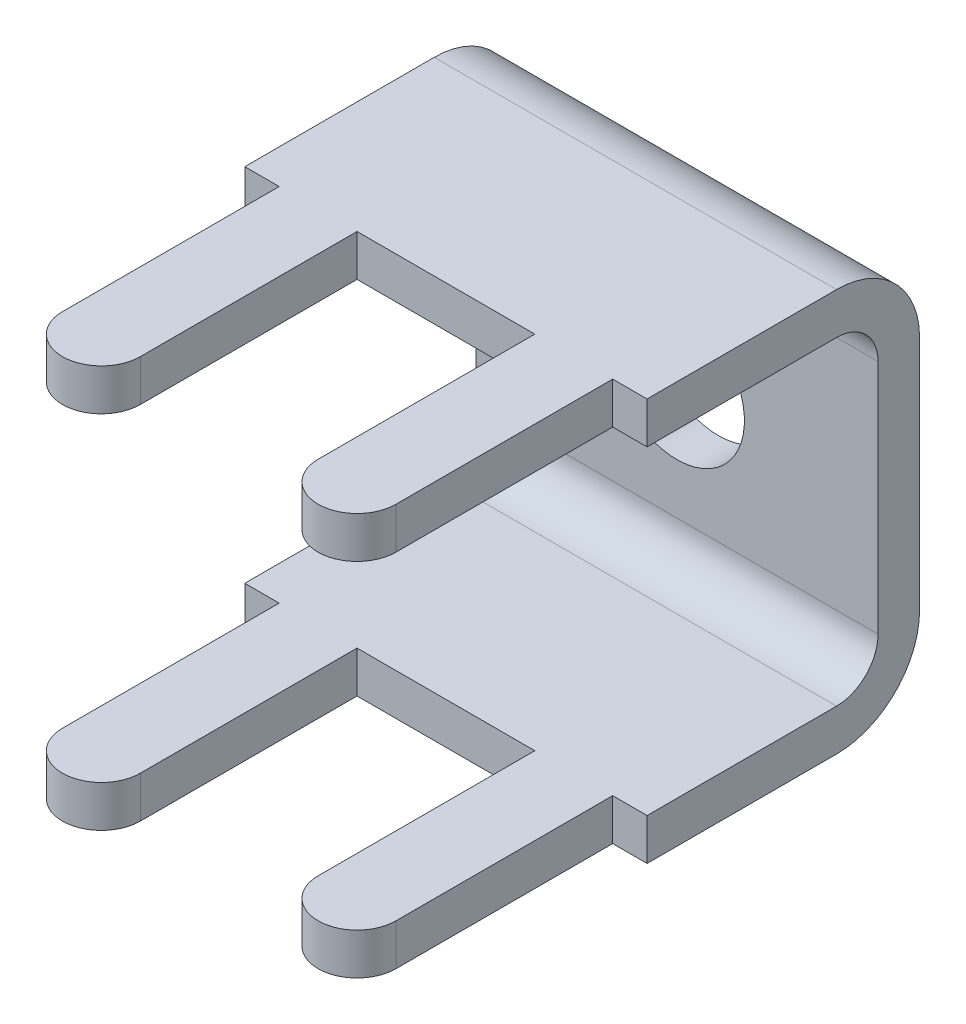
ISO-10303-21;
HEADER;
FILE_DESCRIPTION(('STEP AP214'),'2;1');
FILE_NAME('part.step','',(''),(''),'','','');
FILE_SCHEMA(('AUTOMOTIVE_DESIGN { 1 0 10303 214 1 1 1 1 }'));
ENDSEC;
DATA;
#1=APPLICATION_CONTEXT('core data for automotive mechanical design processes');
#2=APPLICATION_PROTOCOL_DEFINITION('international standard','automotive_design',2000,#1);
#3=PRODUCT_CONTEXT('',#1,'mechanical');
#4=PRODUCT('Part','Part','',(#3));
#5=PRODUCT_RELATED_PRODUCT_CATEGORY('part','',(#4));
#6=PRODUCT_DEFINITION_FORMATION('','',#4);
#7=PRODUCT_DEFINITION_CONTEXT('part definition',#1,'design');
#8=PRODUCT_DEFINITION('design','',#6,#7);
#9=PRODUCT_DEFINITION_SHAPE('','',#8);
#10=(LENGTH_UNIT() NAMED_UNIT(*) SI_UNIT(.MILLI.,.METRE.));
#11=(NAMED_UNIT(*) PLANE_ANGLE_UNIT() SI_UNIT($,.RADIAN.));
#12=(NAMED_UNIT(*) SI_UNIT($,.STERADIAN.) SOLID_ANGLE_UNIT());
#13=UNCERTAINTY_MEASURE_WITH_UNIT(LENGTH_MEASURE(1.E-05),#10,'distance_accuracy_value','');
#14=(GEOMETRIC_REPRESENTATION_CONTEXT(3) GLOBAL_UNCERTAINTY_ASSIGNED_CONTEXT((#13)) GLOBAL_UNIT_ASSIGNED_CONTEXT((#10,
#11,#12)) REPRESENTATION_CONTEXT('',''));
#15=CARTESIAN_POINT('',(0.,0.,0.));
#16=DIRECTION('',(0.,0.,1.));
#17=DIRECTION('',(1.,0.,0.));
#18=AXIS2_PLACEMENT_3D('',#15,#16,#17);
#19=CARTESIAN_POINT('',(3.937,3.937,0.812800000000003));
#20=DIRECTION('',(0.,0.,-1.));
#21=DIRECTION('',(-1.,0.,0.));
#22=AXIS2_PLACEMENT_3D('',#19,#20,#21);
#23=CYLINDRICAL_SURFACE('',#22,1.3208);
#24=CARTESIAN_POINT('',(3.937,3.937,0.));
#25=DIRECTION('',(0.,0.,-1.));
#26=DIRECTION('',(-1.,0.,0.));
#27=AXIS2_PLACEMENT_3D('',#24,#25,#26);
#28=CIRCLE('',#27,1.3208);
#29=CARTESIAN_POINT('',(2.6162,3.937,0.));
#30=VERTEX_POINT('',#29);
#31=EDGE_CURVE('E387',#30,#30,#28,.F.);
#32=ORIENTED_EDGE('',*,*,#31,.F.);
#33=EDGE_LOOP('',(#32));
#34=FACE_BOUND('',#33,.T.);
#35=CARTESIAN_POINT('',(3.937,3.937,0.8128));
#36=DIRECTION('',(0.,0.,-1.));
#37=DIRECTION('',(-1.,0.,0.));
#38=AXIS2_PLACEMENT_3D('',#35,#36,#37);
#39=CIRCLE('',#38,1.3208);
#40=CARTESIAN_POINT('',(2.6162,3.937,0.8128));
#41=VERTEX_POINT('',#40);
#42=EDGE_CURVE('E218',#41,#41,#39,.T.);
#43=ORIENTED_EDGE('',*,*,#42,.F.);
#44=EDGE_LOOP('',(#43));
#45=FACE_BOUND('',#44,.T.);
#46=ADVANCED_FACE('F17',(#34,#45),#23,.F.);
#47=CARTESIAN_POINT('',(7.874,1.6256,1.6256));
#48=DIRECTION('',(-1.,0.,0.));
#49=DIRECTION('',(0.,0.,1.));
#50=AXIS2_PLACEMENT_3D('',#47,#48,#49);
#51=CYLINDRICAL_SURFACE('',#50,0.8128);
#52=DIRECTION('',(1.,0.,0.));
#53=VECTOR('',#52,1.);
#54=CARTESIAN_POINT('',(-0.3937,1.6256,0.8128));
#55=LINE('',#54,#53);
#56=CARTESIAN_POINT('',(0.,1.6256,0.8128));
#57=VERTEX_POINT('',#56);
#58=CARTESIAN_POINT('',(7.874,1.6256,0.8128));
#59=VERTEX_POINT('',#58);
#60=EDGE_CURVE('E205',#57,#59,#55,.T.);
#61=ORIENTED_EDGE('',*,*,#60,.F.);
#62=CARTESIAN_POINT('',(0.,1.6256,1.6256));
#63=DIRECTION('',(-1.,0.,0.));
#64=DIRECTION('',(0.,0.,1.));
#65=AXIS2_PLACEMENT_3D('',#62,#63,#64);
#66=CIRCLE('',#65,0.8128);
#67=CARTESIAN_POINT('',(0.,0.8128,1.6256));
#68=VERTEX_POINT('',#67);
#69=EDGE_CURVE('E210',#57,#68,#66,.T.);
#70=ORIENTED_EDGE('',*,*,#69,.T.);
#71=DIRECTION('',(1.,0.,0.));
#72=VECTOR('',#71,1.);
#73=CARTESIAN_POINT('',(-0.3937,0.8128,1.6256));
#74=LINE('',#73,#72);
#75=CARTESIAN_POINT('',(7.874,0.812800000000002,1.6256));
#76=VERTEX_POINT('',#75);
#77=EDGE_CURVE('E208',#76,#68,#74,.F.);
#78=ORIENTED_EDGE('',*,*,#77,.F.);
#79=CARTESIAN_POINT('',(7.874,1.6256,1.6256));
#80=DIRECTION('',(-1.,0.,0.));
#81=DIRECTION('',(0.,0.,1.));
#82=AXIS2_PLACEMENT_3D('',#79,#80,#81);
#83=CIRCLE('',#82,0.8128);
#84=EDGE_CURVE('E20',#76,#59,#83,.F.);
#85=ORIENTED_EDGE('',*,*,#84,.T.);
#86=EDGE_LOOP('',(#61,#70,#78,#85));
#87=FACE_BOUND('',#86,.T.);
#88=ADVANCED_FACE('F204',(#87),#51,.F.);
#89=CARTESIAN_POINT('',(6.4389,0.8128,9.5758));
#90=DIRECTION('',(0.,1.,0.));
#91=DIRECTION('',(0.,0.,1.));
#92=AXIS2_PLACEMENT_3D('',#89,#90,#91);
#93=CYLINDRICAL_SURFACE('',#92,0.761999999999983);
#94=CARTESIAN_POINT('',(6.4389,0.,9.5758));
#95=DIRECTION('',(0.,1.,0.));
#96=DIRECTION('',(0.,0.,1.));
#97=AXIS2_PLACEMENT_3D('',#94,#95,#96);
#98=CIRCLE('',#97,0.761999999999983);
#99=CARTESIAN_POINT('',(7.2009,0.,9.5758));
#100=VERTEX_POINT('',#99);
#101=CARTESIAN_POINT('',(5.6769,0.,9.5758));
#102=VERTEX_POINT('',#101);
#103=EDGE_CURVE('E376',#100,#102,#98,.F.);
#104=ORIENTED_EDGE('',*,*,#103,.F.);
#105=DIRECTION('',(0.,1.,0.));
#106=VECTOR('',#105,1.);
#107=CARTESIAN_POINT('',(7.2009,-0.0406399999999987,9.5758));
#108=LINE('',#107,#106);
#109=CARTESIAN_POINT('',(7.2009,0.8128,9.5758));
#110=VERTEX_POINT('',#109);
#111=EDGE_CURVE('E410',#110,#100,#108,.F.);
#112=ORIENTED_EDGE('',*,*,#111,.F.);
#113=CARTESIAN_POINT('',(6.4389,0.8128,9.5758));
#114=DIRECTION('',(0.,1.,0.));
#115=DIRECTION('',(0.,0.,1.));
#116=AXIS2_PLACEMENT_3D('',#113,#114,#115);
#117=CIRCLE('',#116,0.761999999999983);
#118=CARTESIAN_POINT('',(5.6769,0.8128,9.5758));
#119=VERTEX_POINT('',#118);
#120=EDGE_CURVE('E476',#119,#110,#117,.T.);
#121=ORIENTED_EDGE('',*,*,#120,.F.);
#122=DIRECTION('',(0.,1.,0.));
#123=VECTOR('',#122,1.);
#124=CARTESIAN_POINT('',(5.6769,-0.040639999999999,9.5758));
#125=LINE('',#124,#123);
#126=EDGE_CURVE('E438',#102,#119,#125,.T.);
#127=ORIENTED_EDGE('',*,*,#126,.F.);
#128=EDGE_LOOP('',(#104,#112,#121,#127));
#129=FACE_BOUND('',#128,.T.);
#130=ADVANCED_FACE('F757',(#129),#93,.T.);
#131=CARTESIAN_POINT('',(5.6769,-0.040639999999999,5.12191));
#132=DIRECTION('',(-1.,0.,0.));
#133=DIRECTION('',(0.,0.,1.));
#134=AXIS2_PLACEMENT_3D('',#131,#132,#133);
#135=PLANE('',#134);
#136=DIRECTION('',(0.,1.,0.));
#137=VECTOR('',#136,1.);
#138=CARTESIAN_POINT('',(5.6769,-0.0406399999999995,5.334));
#139=LINE('',#138,#137);
#140=CARTESIAN_POINT('',(5.6769,0.,5.334));
#141=VERTEX_POINT('',#140);
#142=CARTESIAN_POINT('',(5.6769,0.8128,5.334));
#143=VERTEX_POINT('',#142);
#144=EDGE_CURVE('E427',#141,#143,#139,.T.);
#145=ORIENTED_EDGE('',*,*,#144,.F.);
#146=DIRECTION('',(0.,0.,-1.));
#147=VECTOR('',#146,1.);
#148=CARTESIAN_POINT('',(5.6769,0.,10.77341));
#149=LINE('',#148,#147);
#150=EDGE_CURVE('E434',#102,#141,#149,.T.);
#151=ORIENTED_EDGE('',*,*,#150,.F.);
#152=ORIENTED_EDGE('',*,*,#126,.T.);
#153=DIRECTION('',(0.,0.,1.));
#154=VECTOR('',#153,1.);
#155=CARTESIAN_POINT('',(5.6769,0.8128,1.18999));
#156=LINE('',#155,#154);
#157=EDGE_CURVE('E416',#143,#119,#156,.T.);
#158=ORIENTED_EDGE('',*,*,#157,.F.);
#159=EDGE_LOOP('',(#145,#151,#152,#158));
#160=FACE_BOUND('',#159,.T.);
#161=ADVANCED_FACE('F749',(#160),#135,.T.);
#162=CARTESIAN_POINT('',(2.02311,-0.0406399999999995,5.334));
#163=DIRECTION('',(0.,0.,1.));
#164=DIRECTION('',(1.,0.,0.));
#165=AXIS2_PLACEMENT_3D('',#162,#163,#164);
#166=PLANE('',#165);
#167=ORIENTED_EDGE('',*,*,#144,.T.);
#168=DIRECTION('',(1.,0.,0.));
#169=VECTOR('',#168,1.);
#170=CARTESIAN_POINT('',(-0.3937,0.8128,5.334));
#171=LINE('',#170,#169);
#172=CARTESIAN_POINT('',(2.1971,0.8128,5.334));
#173=VERTEX_POINT('',#172);
#174=EDGE_CURVE('E443',#173,#143,#171,.T.);
#175=ORIENTED_EDGE('',*,*,#174,.F.);
#176=DIRECTION('',(0.,1.,0.));
#177=VECTOR('',#176,1.);
#178=CARTESIAN_POINT('',(2.1971,-0.0406399999999995,5.334));
#179=LINE('',#178,#177);
#180=CARTESIAN_POINT('',(2.1971,0.,5.334));
#181=VERTEX_POINT('',#180);
#182=EDGE_CURVE('E425',#181,#173,#179,.T.);
#183=ORIENTED_EDGE('',*,*,#182,.F.);
#184=DIRECTION('',(1.,0.,0.));
#185=VECTOR('',#184,1.);
#186=CARTESIAN_POINT('',(-0.3937,0.,5.334));
#187=LINE('',#186,#185);
#188=EDGE_CURVE('E430',#141,#181,#187,.F.);
#189=ORIENTED_EDGE('',*,*,#188,.F.);
#190=EDGE_LOOP('',(#167,#175,#183,#189));
#191=FACE_BOUND('',#190,.T.);
#192=ADVANCED_FACE('F741',(#191),#166,.T.);
#193=CARTESIAN_POINT('',(2.1971,-0.0406399999999995,9.78789));
#194=DIRECTION('',(1.,0.,0.));
#195=DIRECTION('',(0.,0.,-1.));
#196=AXIS2_PLACEMENT_3D('',#193,#194,#195);
#197=PLANE('',#196);
#198=ORIENTED_EDGE('',*,*,#182,.T.);
#199=DIRECTION('',(0.,0.,1.));
#200=VECTOR('',#199,1.);
#201=CARTESIAN_POINT('',(2.1971,0.8128,1.18999));
#202=LINE('',#201,#200);
#203=CARTESIAN_POINT('',(2.19710000000001,0.8128,9.5758));
#204=VERTEX_POINT('',#203);
#205=EDGE_CURVE('E446',#204,#173,#202,.F.);
#206=ORIENTED_EDGE('',*,*,#205,.F.);
#207=DIRECTION('',(0.,1.,0.));
#208=VECTOR('',#207,1.);
#209=CARTESIAN_POINT('',(2.19710000000001,0.4064,9.5758));
#210=LINE('',#209,#208);
#211=CARTESIAN_POINT('',(2.19710000000001,0.,9.5758));
#212=VERTEX_POINT('',#211);
#213=EDGE_CURVE('E423',#212,#204,#210,.T.);
#214=ORIENTED_EDGE('',*,*,#213,.F.);
#215=DIRECTION('',(0.,0.,-1.));
#216=VECTOR('',#215,1.);
#217=CARTESIAN_POINT('',(2.1971,0.,10.77341));
#218=LINE('',#217,#216);
#219=EDGE_CURVE('E433',#181,#212,#218,.F.);
#220=ORIENTED_EDGE('',*,*,#219,.F.);
#221=EDGE_LOOP('',(#198,#206,#214,#220));
#222=FACE_BOUND('',#221,.T.);
#223=ADVANCED_FACE('F733',(#222),#197,.T.);
#224=CARTESIAN_POINT('',(1.4351,0.8128,9.5758));
#225=DIRECTION('',(0.,1.,0.));
#226=DIRECTION('',(-1.,0.,0.));
#227=AXIS2_PLACEMENT_3D('',#224,#225,#226);
#228=CYLINDRICAL_SURFACE('',#227,0.76200000000001);
#229=CARTESIAN_POINT('',(1.4351,0.,9.5758));
#230=DIRECTION('',(0.,1.,0.));
#231=DIRECTION('',(-1.,0.,0.));
#232=AXIS2_PLACEMENT_3D('',#229,#230,#231);
#233=CIRCLE('',#232,0.76200000000001);
#234=CARTESIAN_POINT('',(0.6731,0.,9.5758));
#235=VERTEX_POINT('',#234);
#236=EDGE_CURVE('E468',#212,#235,#233,.F.);
#237=ORIENTED_EDGE('',*,*,#236,.F.);
#238=ORIENTED_EDGE('',*,*,#213,.T.);
#239=CARTESIAN_POINT('',(1.4351,0.8128,9.5758));
#240=DIRECTION('',(0.,1.,0.));
#241=DIRECTION('',(-1.,0.,0.));
#242=AXIS2_PLACEMENT_3D('',#239,#240,#241);
#243=CIRCLE('',#242,0.76200000000001);
#244=CARTESIAN_POINT('',(0.6731,0.8128,9.5758));
#245=VERTEX_POINT('',#244);
#246=EDGE_CURVE('E473',#245,#204,#243,.T.);
#247=ORIENTED_EDGE('',*,*,#246,.F.);
#248=DIRECTION('',(0.,1.,0.));
#249=VECTOR('',#248,1.);
#250=CARTESIAN_POINT('',(0.6731,-0.0406399999999995,9.5758));
#251=LINE('',#250,#249);
#252=EDGE_CURVE('E414',#235,#245,#251,.T.);
#253=ORIENTED_EDGE('',*,*,#252,.F.);
#254=EDGE_LOOP('',(#237,#238,#247,#253));
#255=FACE_BOUND('',#254,.T.);
#256=ADVANCED_FACE('F725',(#255),#228,.T.);
#257=CARTESIAN_POINT('',(0.6731,-0.0406399999999995,5.12191));
#258=DIRECTION('',(-1.,0.,0.));
#259=DIRECTION('',(0.,0.,1.));
#260=AXIS2_PLACEMENT_3D('',#257,#258,#259);
#261=PLANE('',#260);
#262=DIRECTION('',(0.,1.,0.));
#263=VECTOR('',#262,1.);
#264=CARTESIAN_POINT('',(0.6731,-0.0406399999999997,5.334));
#265=LINE('',#264,#263);
#266=CARTESIAN_POINT('',(0.6731,0.,5.334));
#267=VERTEX_POINT('',#266);
#268=CARTESIAN_POINT('',(0.6731,0.8128,5.334));
#269=VERTEX_POINT('',#268);
#270=EDGE_CURVE('E413',#267,#269,#265,.T.);
#271=ORIENTED_EDGE('',*,*,#270,.F.);
#272=DIRECTION('',(0.,0.,-1.));
#273=VECTOR('',#272,1.);
#274=CARTESIAN_POINT('',(0.6731,0.,10.77341));
#275=LINE('',#274,#273);
#276=EDGE_CURVE('E401',#235,#267,#275,.T.);
#277=ORIENTED_EDGE('',*,*,#276,.F.);
#278=ORIENTED_EDGE('',*,*,#252,.T.);
#279=DIRECTION('',(0.,0.,1.));
#280=VECTOR('',#279,1.);
#281=CARTESIAN_POINT('',(0.6731,0.8128,1.18999));
#282=LINE('',#281,#280);
#283=EDGE_CURVE('E390',#269,#245,#282,.T.);
#284=ORIENTED_EDGE('',*,*,#283,.F.);
#285=EDGE_LOOP('',(#271,#277,#278,#284));
#286=FACE_BOUND('',#285,.T.);
#287=ADVANCED_FACE('F717',(#286),#261,.T.);
#288=CARTESIAN_POINT('',(7.2009,-0.0406399999999987,9.78789));
#289=DIRECTION('',(1.,0.,0.));
#290=DIRECTION('',(0.,0.,-1.));
#291=AXIS2_PLACEMENT_3D('',#288,#289,#290);
#292=PLANE('',#291);
#293=DIRECTION('',(0.,1.,0.));
#294=VECTOR('',#293,1.);
#295=CARTESIAN_POINT('',(7.2009,-0.0406399999999987,5.334));
#296=LINE('',#295,#294);
#297=CARTESIAN_POINT('',(7.2009,0.812800000000002,5.334));
#298=VERTEX_POINT('',#297);
#299=CARTESIAN_POINT('',(7.2009,0.,5.334));
#300=VERTEX_POINT('',#299);
#301=EDGE_CURVE('E377',#298,#300,#296,.F.);
#302=ORIENTED_EDGE('',*,*,#301,.F.);
#303=DIRECTION('',(0.,0.,1.));
#304=VECTOR('',#303,1.);
#305=CARTESIAN_POINT('',(7.2009,0.8128,1.18999));
#306=LINE('',#305,#304);
#307=EDGE_CURVE('E381',#110,#298,#306,.F.);
#308=ORIENTED_EDGE('',*,*,#307,.F.);
#309=ORIENTED_EDGE('',*,*,#111,.T.);
#310=DIRECTION('',(0.,0.,-1.));
#311=VECTOR('',#310,1.);
#312=CARTESIAN_POINT('',(7.2009,0.,10.77341));
#313=LINE('',#312,#311);
#314=EDGE_CURVE('E361',#300,#100,#313,.F.);
#315=ORIENTED_EDGE('',*,*,#314,.F.);
#316=EDGE_LOOP('',(#302,#308,#309,#315));
#317=FACE_BOUND('',#316,.T.);
#318=ADVANCED_FACE('F709',(#317),#292,.T.);
#319=CARTESIAN_POINT('',(-0.0336550000000005,-0.0406399999999997,5.334));
#320=DIRECTION('',(0.,0.,1.));
#321=DIRECTION('',(1.,0.,0.));
#322=AXIS2_PLACEMENT_3D('',#319,#320,#321);
#323=PLANE('',#322);
#324=DIRECTION('',(0.,1.,0.));
#325=VECTOR('',#324,1.);
#326=CARTESIAN_POINT('',(0.,-0.3937,5.334));
#327=LINE('',#326,#325);
#328=CARTESIAN_POINT('',(0.,0.,5.334));
#329=VERTEX_POINT('',#328);
#330=CARTESIAN_POINT('',(0.,0.8128,5.334));
#331=VERTEX_POINT('',#330);
#332=EDGE_CURVE('E393',#329,#331,#327,.T.);
#333=ORIENTED_EDGE('',*,*,#332,.F.);
#334=DIRECTION('',(1.,0.,0.));
#335=VECTOR('',#334,1.);
#336=CARTESIAN_POINT('',(-0.3937,0.,5.334));
#337=LINE('',#336,#335);
#338=EDGE_CURVE('E365',#267,#329,#337,.F.);
#339=ORIENTED_EDGE('',*,*,#338,.F.);
#340=ORIENTED_EDGE('',*,*,#270,.T.);
#341=DIRECTION('',(1.,0.,0.));
#342=VECTOR('',#341,1.);
#343=CARTESIAN_POINT('',(-0.3937,0.8128,5.334));
#344=LINE('',#343,#342);
#345=EDGE_CURVE('E380',#331,#269,#344,.T.);
#346=ORIENTED_EDGE('',*,*,#345,.F.);
#347=EDGE_LOOP('',(#333,#339,#340,#346));
#348=FACE_BOUND('',#347,.T.);
#349=ADVANCED_FACE('F701',(#348),#323,.T.);
#350=CARTESIAN_POINT('',(8.2677,1.39446,0.));
#351=DIRECTION('',(0.,0.,-1.));
#352=DIRECTION('',(-1.,0.,0.));
#353=AXIS2_PLACEMENT_3D('',#350,#351,#352);
#354=PLANE('',#353);
#355=ORIENTED_EDGE('',*,*,#31,.T.);
#356=EDGE_LOOP('',(#355));
#357=FACE_BOUND('',#356,.T.);
#358=DIRECTION('',(-1.,0.,0.));
#359=VECTOR('',#358,1.);
#360=CARTESIAN_POINT('',(3.93700000000001,6.2484,0.));
#361=LINE('',#360,#359);
#362=CARTESIAN_POINT('',(7.874,6.2484,0.));
#363=VERTEX_POINT('',#362);
#364=CARTESIAN_POINT('',(0.,6.2484,0.));
#365=VERTEX_POINT('',#364);
#366=EDGE_CURVE('E219',#363,#365,#361,.T.);
#367=ORIENTED_EDGE('',*,*,#366,.F.);
#368=DIRECTION('',(0.,1.,0.));
#369=VECTOR('',#368,1.);
#370=CARTESIAN_POINT('',(7.874,-0.3937,0.));
#371=LINE('',#370,#369);
#372=CARTESIAN_POINT('',(7.874,1.6256,0.));
#373=VERTEX_POINT('',#372);
#374=EDGE_CURVE('E238',#373,#363,#371,.T.);
#375=ORIENTED_EDGE('',*,*,#374,.F.);
#376=DIRECTION('',(1.,0.,0.));
#377=VECTOR('',#376,1.);
#378=CARTESIAN_POINT('',(3.937,1.6256,0.));
#379=LINE('',#378,#377);
#380=CARTESIAN_POINT('',(0.,1.6256,0.));
#381=VERTEX_POINT('',#380);
#382=EDGE_CURVE('E355',#381,#373,#379,.T.);
#383=ORIENTED_EDGE('',*,*,#382,.F.);
#384=DIRECTION('',(0.,1.,0.));
#385=VECTOR('',#384,1.);
#386=CARTESIAN_POINT('',(0.,-0.3937,0.));
#387=LINE('',#386,#385);
#388=EDGE_CURVE('E463',#365,#381,#387,.F.);
#389=ORIENTED_EDGE('',*,*,#388,.F.);
#390=EDGE_LOOP('',(#367,#375,#383,#389));
#391=FACE_BOUND('',#390,.T.);
#392=ADVANCED_FACE('F521',(#357,#391),#354,.T.);
#393=CARTESIAN_POINT('',(7.874,6.2484,1.6256));
#394=DIRECTION('',(1.,0.,0.));
#395=DIRECTION('',(0.,0.,-1.));
#396=AXIS2_PLACEMENT_3D('',#393,#394,#395);
#397=CYLINDRICAL_SURFACE('',#396,1.6256);
#398=ORIENTED_EDGE('',*,*,#366,.T.);
#399=CARTESIAN_POINT('',(0.,6.2484,1.6256));
#400=DIRECTION('',(1.,0.,0.));
#401=DIRECTION('',(0.,0.,-1.));
#402=AXIS2_PLACEMENT_3D('',#399,#400,#401);
#403=CIRCLE('',#402,1.6256);
#404=CARTESIAN_POINT('',(0.,7.874,1.6256));
#405=VERTEX_POINT('',#404);
#406=EDGE_CURVE('E464',#405,#365,#403,.F.);
#407=ORIENTED_EDGE('',*,*,#406,.F.);
#408=DIRECTION('',(1.,0.,0.));
#409=VECTOR('',#408,1.);
#410=CARTESIAN_POINT('',(-0.393699999999992,7.874,1.6256));
#411=LINE('',#410,#409);
#412=CARTESIAN_POINT('',(7.874,7.874,1.6256));
#413=VERTEX_POINT('',#412);
#414=EDGE_CURVE('E358',#413,#405,#411,.F.);
#415=ORIENTED_EDGE('',*,*,#414,.F.);
#416=CARTESIAN_POINT('',(7.874,6.2484,1.6256));
#417=DIRECTION('',(1.,0.,0.));
#418=DIRECTION('',(0.,0.,-1.));
#419=AXIS2_PLACEMENT_3D('',#416,#417,#418);
#420=CIRCLE('',#419,1.6256);
#421=EDGE_CURVE('E235',#363,#413,#420,.T.);
#422=ORIENTED_EDGE('',*,*,#421,.F.);
#423=EDGE_LOOP('',(#398,#407,#415,#422));
#424=FACE_BOUND('',#423,.T.);
#425=ADVANCED_FACE('F526',(#424),#397,.T.);
#426=CARTESIAN_POINT('',(-0.3937,1.39446,0.8128));
#427=DIRECTION('',(0.,0.,1.));
#428=DIRECTION('',(1.,0.,0.));
#429=AXIS2_PLACEMENT_3D('',#426,#427,#428);
#430=PLANE('',#429);
#431=ORIENTED_EDGE('',*,*,#42,.T.);
#432=EDGE_LOOP('',(#431));
#433=FACE_BOUND('',#432,.T.);
#434=DIRECTION('',(1.,0.,0.));
#435=VECTOR('',#434,1.);
#436=CARTESIAN_POINT('',(3.93700000000001,6.2484,0.8128));
#437=LINE('',#436,#435);
#438=CARTESIAN_POINT('',(0.,6.2484,0.8128));
#439=VERTEX_POINT('',#438);
#440=CARTESIAN_POINT('',(7.874,6.2484,0.8128));
#441=VERTEX_POINT('',#440);
#442=EDGE_CURVE('E240',#439,#441,#437,.T.);
#443=ORIENTED_EDGE('',*,*,#442,.F.);
#444=DIRECTION('',(0.,1.,0.));
#445=VECTOR('',#444,1.);
#446=CARTESIAN_POINT('',(0.,-0.3937,0.8128));
#447=LINE('',#446,#445);
#448=EDGE_CURVE('E217',#57,#439,#447,.T.);
#449=ORIENTED_EDGE('',*,*,#448,.F.);
#450=ORIENTED_EDGE('',*,*,#60,.T.);
#451=DIRECTION('',(0.,1.,0.));
#452=VECTOR('',#451,1.);
#453=CARTESIAN_POINT('',(7.874,-0.3937,0.8128));
#454=LINE('',#453,#452);
#455=EDGE_CURVE('E215',#441,#59,#454,.F.);
#456=ORIENTED_EDGE('',*,*,#455,.F.);
#457=EDGE_LOOP('',(#443,#449,#450,#456));
#458=FACE_BOUND('',#457,.T.);
#459=ADVANCED_FACE('F214',(#433,#458),#430,.T.);
#460=CARTESIAN_POINT('',(-0.3937,0.8128,1.18999));
#461=DIRECTION('',(0.,1.,0.));
#462=DIRECTION('',(0.,0.,1.));
#463=AXIS2_PLACEMENT_3D('',#460,#461,#462);
#464=PLANE('',#463);
#465=ORIENTED_EDGE('',*,*,#174,.T.);
#466=ORIENTED_EDGE('',*,*,#157,.T.);
#467=ORIENTED_EDGE('',*,*,#120,.T.);
#468=ORIENTED_EDGE('',*,*,#307,.T.);
#469=DIRECTION('',(1.,0.,0.));
#470=VECTOR('',#469,1.);
#471=CARTESIAN_POINT('',(7.167245,0.812800000000003,5.334));
#472=LINE('',#471,#470);
#473=CARTESIAN_POINT('',(7.874,0.812800000000003,5.334));
#474=VERTEX_POINT('',#473);
#475=EDGE_CURVE('E373',#474,#298,#472,.F.);
#476=ORIENTED_EDGE('',*,*,#475,.F.);
#477=DIRECTION('',(0.,0.,-1.));
#478=VECTOR('',#477,1.);
#479=CARTESIAN_POINT('',(7.874,0.812800000000003,5.6007));
#480=LINE('',#479,#478);
#481=EDGE_CURVE('E225',#76,#474,#480,.F.);
#482=ORIENTED_EDGE('',*,*,#481,.F.);
#483=ORIENTED_EDGE('',*,*,#77,.T.);
#484=DIRECTION('',(0.,0.,1.));
#485=VECTOR('',#484,1.);
#486=CARTESIAN_POINT('',(0.,0.8128,-0.2667));
#487=LINE('',#486,#485);
#488=EDGE_CURVE('E396',#331,#68,#487,.F.);
#489=ORIENTED_EDGE('',*,*,#488,.F.);
#490=ORIENTED_EDGE('',*,*,#345,.T.);
#491=ORIENTED_EDGE('',*,*,#283,.T.);
#492=ORIENTED_EDGE('',*,*,#246,.T.);
#493=ORIENTED_EDGE('',*,*,#205,.T.);
#494=EDGE_LOOP('',(#465,#466,#467,#468,#476,#482,#483,#489,#490,#491,#492,#493));
#495=FACE_BOUND('',#494,.T.);
#496=ADVANCED_FACE('F486',(#495),#464,.T.);
#497=CARTESIAN_POINT('',(7.167245,-0.0406399999999987,5.334));
#498=DIRECTION('',(0.,0.,1.));
#499=DIRECTION('',(1.,0.,0.));
#500=AXIS2_PLACEMENT_3D('',#497,#498,#499);
#501=PLANE('',#500);
#502=DIRECTION('',(0.,1.,0.));
#503=VECTOR('',#502,1.);
#504=CARTESIAN_POINT('',(7.874,-0.3937,5.334));
#505=LINE('',#504,#503);
#506=CARTESIAN_POINT('',(7.874,0.,5.334));
#507=VERTEX_POINT('',#506);
#508=EDGE_CURVE('E227',#474,#507,#505,.F.);
#509=ORIENTED_EDGE('',*,*,#508,.F.);
#510=ORIENTED_EDGE('',*,*,#475,.T.);
#511=ORIENTED_EDGE('',*,*,#301,.T.);
#512=DIRECTION('',(1.,0.,0.));
#513=VECTOR('',#512,1.);
#514=CARTESIAN_POINT('',(-0.3937,0.,5.334));
#515=LINE('',#514,#513);
#516=EDGE_CURVE('E362',#507,#300,#515,.F.);
#517=ORIENTED_EDGE('',*,*,#516,.F.);
#518=EDGE_LOOP('',(#509,#510,#511,#517));
#519=FACE_BOUND('',#518,.T.);
#520=ADVANCED_FACE('F668',(#519),#501,.T.);
#521=CARTESIAN_POINT('',(-0.3937,0.,10.77341));
#522=DIRECTION('',(0.,-1.,0.));
#523=DIRECTION('',(0.,0.,-1.));
#524=AXIS2_PLACEMENT_3D('',#521,#522,#523);
#525=PLANE('',#524);
#526=ORIENTED_EDGE('',*,*,#516,.T.);
#527=ORIENTED_EDGE('',*,*,#314,.T.);
#528=ORIENTED_EDGE('',*,*,#103,.T.);
#529=ORIENTED_EDGE('',*,*,#150,.T.);
#530=ORIENTED_EDGE('',*,*,#188,.T.);
#531=ORIENTED_EDGE('',*,*,#219,.T.);
#532=ORIENTED_EDGE('',*,*,#236,.T.);
#533=ORIENTED_EDGE('',*,*,#276,.T.);
#534=ORIENTED_EDGE('',*,*,#338,.T.);
#535=DIRECTION('',(0.,0.,1.));
#536=VECTOR('',#535,1.);
#537=CARTESIAN_POINT('',(0.,0.,-0.2667));
#538=LINE('',#537,#536);
#539=CARTESIAN_POINT('',(0.,0.,1.6256));
#540=VERTEX_POINT('',#539);
#541=EDGE_CURVE('E397',#540,#329,#538,.T.);
#542=ORIENTED_EDGE('',*,*,#541,.F.);
#543=DIRECTION('',(-1.,0.,0.));
#544=VECTOR('',#543,1.);
#545=CARTESIAN_POINT('',(3.937,0.,1.6256));
#546=LINE('',#545,#544);
#547=CARTESIAN_POINT('',(7.874,0.,1.6256));
#548=VERTEX_POINT('',#547);
#549=EDGE_CURVE('E359',#548,#540,#546,.T.);
#550=ORIENTED_EDGE('',*,*,#549,.F.);
#551=DIRECTION('',(0.,0.,-1.));
#552=VECTOR('',#551,1.);
#553=CARTESIAN_POINT('',(7.874,0.,5.6007));
#554=LINE('',#553,#552);
#555=EDGE_CURVE('E370',#507,#548,#554,.T.);
#556=ORIENTED_EDGE('',*,*,#555,.F.);
#557=EDGE_LOOP('',(#526,#527,#528,#529,#530,#531,#532,#533,#534,#542,#550,#556));
#558=FACE_BOUND('',#557,.T.);
#559=ADVANCED_FACE('F513',(#558),#525,.T.);
#560=CARTESIAN_POINT('',(0.,1.6256,1.6256));
#561=DIRECTION('',(-1.,0.,0.));
#562=DIRECTION('',(0.,0.,1.));
#563=AXIS2_PLACEMENT_3D('',#560,#561,#562);
#564=CYLINDRICAL_SURFACE('',#563,1.6256);
#565=ORIENTED_EDGE('',*,*,#382,.T.);
#566=CARTESIAN_POINT('',(7.874,1.6256,1.6256));
#567=DIRECTION('',(-1.,0.,0.));
#568=DIRECTION('',(0.,0.,1.));
#569=AXIS2_PLACEMENT_3D('',#566,#567,#568);
#570=CIRCLE('',#569,1.6256);
#571=EDGE_CURVE('E303',#548,#373,#570,.F.);
#572=ORIENTED_EDGE('',*,*,#571,.F.);
#573=ORIENTED_EDGE('',*,*,#549,.T.);
#574=CARTESIAN_POINT('',(0.,1.6256,1.6256));
#575=DIRECTION('',(-1.,0.,0.));
#576=DIRECTION('',(0.,0.,1.));
#577=AXIS2_PLACEMENT_3D('',#574,#575,#576);
#578=CIRCLE('',#577,1.6256);
#579=EDGE_CURVE('E460',#381,#540,#578,.T.);
#580=ORIENTED_EDGE('',*,*,#579,.F.);
#581=EDGE_LOOP('',(#565,#572,#573,#580));
#582=FACE_BOUND('',#581,.T.);
#583=ADVANCED_FACE('F518',(#582),#564,.T.);
#584=CARTESIAN_POINT('',(-0.393699999999992,7.874,1.18999));
#585=DIRECTION('',(0.,1.,0.));
#586=DIRECTION('',(0.,0.,1.));
#587=AXIS2_PLACEMENT_3D('',#584,#585,#586);
#588=PLANE('',#587);
#589=DIRECTION('',(1.,0.,0.));
#590=VECTOR('',#589,1.);
#591=CARTESIAN_POINT('',(-0.0336549999999934,7.874,5.334));
#592=LINE('',#591,#590);
#593=CARTESIAN_POINT('',(0.673100000000008,7.874,5.334));
#594=VERTEX_POINT('',#593);
#595=CARTESIAN_POINT('',(0.,7.874,5.334));
#596=VERTEX_POINT('',#595);
#597=EDGE_CURVE('E331',#594,#596,#592,.F.);
#598=ORIENTED_EDGE('',*,*,#597,.F.);
#599=DIRECTION('',(0.,0.,1.));
#600=VECTOR('',#599,1.);
#601=CARTESIAN_POINT('',(0.673100000000008,7.874,5.12191));
#602=LINE('',#601,#600);
#603=CARTESIAN_POINT('',(0.673100000000008,7.874,9.5758));
#604=VERTEX_POINT('',#603);
#605=EDGE_CURVE('E332',#604,#594,#602,.F.);
#606=ORIENTED_EDGE('',*,*,#605,.F.);
#607=CARTESIAN_POINT('',(1.43510000000001,7.874,9.5758));
#608=DIRECTION('',(0.,1.,0.));
#609=DIRECTION('',(0.,0.,1.));
#610=AXIS2_PLACEMENT_3D('',#607,#608,#609);
#611=CIRCLE('',#610,0.762000000000009);
#612=CARTESIAN_POINT('',(2.19710000000001,7.874,9.5758));
#613=VERTEX_POINT('',#612);
#614=EDGE_CURVE('E338',#613,#604,#611,.F.);
#615=ORIENTED_EDGE('',*,*,#614,.F.);
#616=DIRECTION('',(0.,0.,-1.));
#617=VECTOR('',#616,1.);
#618=CARTESIAN_POINT('',(2.19710000000001,7.874,9.78789));
#619=LINE('',#618,#617);
#620=CARTESIAN_POINT('',(2.19710000000001,7.874,5.334));
#621=VERTEX_POINT('',#620);
#622=EDGE_CURVE('E268',#621,#613,#619,.F.);
#623=ORIENTED_EDGE('',*,*,#622,.F.);
#624=DIRECTION('',(1.,0.,0.));
#625=VECTOR('',#624,1.);
#626=CARTESIAN_POINT('',(2.02311000000001,7.874,5.334));
#627=LINE('',#626,#625);
#628=CARTESIAN_POINT('',(5.6769,7.874,5.334));
#629=VERTEX_POINT('',#628);
#630=EDGE_CURVE('E266',#629,#621,#627,.F.);
#631=ORIENTED_EDGE('',*,*,#630,.F.);
#632=DIRECTION('',(0.,0.,1.));
#633=VECTOR('',#632,1.);
#634=CARTESIAN_POINT('',(5.6769,7.874,5.12191));
#635=LINE('',#634,#633);
#636=CARTESIAN_POINT('',(5.6769,7.874,9.5758));
#637=VERTEX_POINT('',#636);
#638=EDGE_CURVE('E278',#637,#629,#635,.F.);
#639=ORIENTED_EDGE('',*,*,#638,.F.);
#640=CARTESIAN_POINT('',(6.4389,7.874,9.5758));
#641=DIRECTION('',(0.,-1.,0.));
#642=DIRECTION('',(0.,0.,-1.));
#643=AXIS2_PLACEMENT_3D('',#640,#641,#642);
#644=CIRCLE('',#643,0.761999999999983);
#645=CARTESIAN_POINT('',(7.20089999999999,7.874,9.5758));
#646=VERTEX_POINT('',#645);
#647=EDGE_CURVE('E284',#646,#637,#644,.T.);
#648=ORIENTED_EDGE('',*,*,#647,.F.);
#649=DIRECTION('',(0.,0.,-1.));
#650=VECTOR('',#649,1.);
#651=CARTESIAN_POINT('',(7.2009,7.874,9.78789));
#652=LINE('',#651,#650);
#653=CARTESIAN_POINT('',(7.2009,7.874,5.334));
#654=VERTEX_POINT('',#653);
#655=EDGE_CURVE('E288',#654,#646,#652,.F.);
#656=ORIENTED_EDGE('',*,*,#655,.F.);
#657=DIRECTION('',(1.,0.,0.));
#658=VECTOR('',#657,1.);
#659=CARTESIAN_POINT('',(7.167245,7.874,5.334));
#660=LINE('',#659,#658);
#661=CARTESIAN_POINT('',(7.874,7.874,5.334));
#662=VERTEX_POINT('',#661);
#663=EDGE_CURVE('E292',#662,#654,#660,.F.);
#664=ORIENTED_EDGE('',*,*,#663,.F.);
#665=DIRECTION('',(0.,0.,-1.));
#666=VECTOR('',#665,1.);
#667=CARTESIAN_POINT('',(7.874,7.874,5.6007));
#668=LINE('',#667,#666);
#669=EDGE_CURVE('E229',#413,#662,#668,.F.);
#670=ORIENTED_EDGE('',*,*,#669,.F.);
#671=ORIENTED_EDGE('',*,*,#414,.T.);
#672=DIRECTION('',(0.,0.,1.));
#673=VECTOR('',#672,1.);
#674=CARTESIAN_POINT('',(0.,7.874,-0.2667));
#675=LINE('',#674,#673);
#676=EDGE_CURVE('E321',#596,#405,#675,.F.);
#677=ORIENTED_EDGE('',*,*,#676,.F.);
#678=EDGE_LOOP('',(#598,#606,#615,#623,#631,#639,#648,#656,#664,#670,#671,#677));
#679=FACE_BOUND('',#678,.T.);
#680=ADVANCED_FACE('F531',(#679),#588,.T.);
#681=CARTESIAN_POINT('',(1.43510000000001,7.874,9.5758));
#682=DIRECTION('',(0.,1.,0.));
#683=DIRECTION('',(0.,0.,1.));
#684=AXIS2_PLACEMENT_3D('',#681,#682,#683);
#685=CYLINDRICAL_SURFACE('',#684,0.762000000000009);
#686=CARTESIAN_POINT('',(1.43510000000001,7.0612,9.5758));
#687=DIRECTION('',(0.,1.,0.));
#688=DIRECTION('',(0.,0.,1.));
#689=AXIS2_PLACEMENT_3D('',#686,#687,#688);
#690=CIRCLE('',#689,0.762000000000009);
#691=CARTESIAN_POINT('',(2.19710000000001,7.0612,9.5758));
#692=VERTEX_POINT('',#691);
#693=CARTESIAN_POINT('',(0.673100000000008,7.0612,9.5758));
#694=VERTEX_POINT('',#693);
#695=EDGE_CURVE('E260',#692,#694,#690,.F.);
#696=ORIENTED_EDGE('',*,*,#695,.F.);
#697=DIRECTION('',(0.,1.,0.));
#698=VECTOR('',#697,1.);
#699=CARTESIAN_POINT('',(2.19710000000001,7.02056,9.5758));
#700=LINE('',#699,#698);
#701=EDGE_CURVE('E263',#613,#692,#700,.F.);
#702=ORIENTED_EDGE('',*,*,#701,.F.);
#703=ORIENTED_EDGE('',*,*,#614,.T.);
#704=DIRECTION('',(0.,1.,0.));
#705=VECTOR('',#704,1.);
#706=CARTESIAN_POINT('',(0.673100000000008,7.02056,9.5758));
#707=LINE('',#706,#705);
#708=EDGE_CURVE('E335',#694,#604,#707,.T.);
#709=ORIENTED_EDGE('',*,*,#708,.F.);
#710=EDGE_LOOP('',(#696,#702,#703,#709));
#711=FACE_BOUND('',#710,.T.);
#712=ADVANCED_FACE('F553',(#711),#685,.T.);
#713=CARTESIAN_POINT('',(0.673100000000008,7.02056,5.12191));
#714=DIRECTION('',(-1.,0.,0.));
#715=DIRECTION('',(0.,0.,1.));
#716=AXIS2_PLACEMENT_3D('',#713,#714,#715);
#717=PLANE('',#716);
#718=DIRECTION('',(0.,1.,0.));
#719=VECTOR('',#718,1.);
#720=CARTESIAN_POINT('',(0.673100000000008,7.02056,5.334));
#721=LINE('',#720,#719);
#722=CARTESIAN_POINT('',(0.673100000000008,7.0612,5.334));
#723=VERTEX_POINT('',#722);
#724=EDGE_CURVE('E328',#723,#594,#721,.T.);
#725=ORIENTED_EDGE('',*,*,#724,.F.);
#726=DIRECTION('',(0.,0.,-1.));
#727=VECTOR('',#726,1.);
#728=CARTESIAN_POINT('',(0.673100000000008,7.0612,10.77341));
#729=LINE('',#728,#727);
#730=EDGE_CURVE('E256',#694,#723,#729,.T.);
#731=ORIENTED_EDGE('',*,*,#730,.F.);
#732=ORIENTED_EDGE('',*,*,#708,.T.);
#733=ORIENTED_EDGE('',*,*,#605,.T.);
#734=EDGE_LOOP('',(#725,#731,#732,#733));
#735=FACE_BOUND('',#734,.T.);
#736=ADVANCED_FACE('F551',(#735),#717,.T.);
#737=CARTESIAN_POINT('',(-0.0336549999999934,7.02056,5.334));
#738=DIRECTION('',(0.,0.,1.));
#739=DIRECTION('',(1.,0.,0.));
#740=AXIS2_PLACEMENT_3D('',#737,#738,#739);
#741=PLANE('',#740);
#742=DIRECTION('',(0.,1.,0.));
#743=VECTOR('',#742,1.);
#744=CARTESIAN_POINT('',(0.,-0.3937,5.334));
#745=LINE('',#744,#743);
#746=CARTESIAN_POINT('',(0.,7.0612,5.334));
#747=VERTEX_POINT('',#746);
#748=EDGE_CURVE('E318',#747,#596,#745,.T.);
#749=ORIENTED_EDGE('',*,*,#748,.F.);
#750=DIRECTION('',(1.,0.,0.));
#751=VECTOR('',#750,1.);
#752=CARTESIAN_POINT('',(-0.393699999999992,7.0612,5.334));
#753=LINE('',#752,#751);
#754=EDGE_CURVE('E259',#723,#747,#753,.F.);
#755=ORIENTED_EDGE('',*,*,#754,.F.);
#756=ORIENTED_EDGE('',*,*,#724,.T.);
#757=ORIENTED_EDGE('',*,*,#597,.T.);
#758=EDGE_LOOP('',(#749,#755,#756,#757));
#759=FACE_BOUND('',#758,.T.);
#760=ADVANCED_FACE('F546',(#759),#741,.T.);
#761=CARTESIAN_POINT('',(0.,-0.3937,-0.2667));
#762=DIRECTION('',(-1.,0.,0.));
#763=DIRECTION('',(0.,0.,1.));
#764=AXIS2_PLACEMENT_3D('',#761,#762,#763);
#765=PLANE('',#764);
#766=ORIENTED_EDGE('',*,*,#488,.T.);
#767=ORIENTED_EDGE('',*,*,#69,.F.);
#768=ORIENTED_EDGE('',*,*,#448,.T.);
#769=CARTESIAN_POINT('',(0.,6.2484,1.6256));
#770=DIRECTION('',(1.,0.,0.));
#771=DIRECTION('',(0.,1.,0.));
#772=AXIS2_PLACEMENT_3D('',#769,#770,#771);
#773=CIRCLE('',#772,0.8128);
#774=CARTESIAN_POINT('',(0.,7.0612,1.6256));
#775=VERTEX_POINT('',#774);
#776=EDGE_CURVE('E384',#775,#439,#773,.F.);
#777=ORIENTED_EDGE('',*,*,#776,.F.);
#778=DIRECTION('',(0.,0.,-1.));
#779=VECTOR('',#778,1.);
#780=CARTESIAN_POINT('',(0.,7.0612,10.77341));
#781=LINE('',#780,#779);
#782=EDGE_CURVE('E313',#747,#775,#781,.T.);
#783=ORIENTED_EDGE('',*,*,#782,.F.);
#784=ORIENTED_EDGE('',*,*,#748,.T.);
#785=ORIENTED_EDGE('',*,*,#676,.T.);
#786=ORIENTED_EDGE('',*,*,#406,.T.);
#787=ORIENTED_EDGE('',*,*,#388,.T.);
#788=ORIENTED_EDGE('',*,*,#579,.T.);
#789=ORIENTED_EDGE('',*,*,#541,.T.);
#790=ORIENTED_EDGE('',*,*,#332,.T.);
#791=EDGE_LOOP('',(#766,#767,#768,#777,#783,#784,#785,#786,#787,#788,#789,#790));
#792=FACE_BOUND('',#791,.T.);
#793=ADVANCED_FACE('F487',(#792),#765,.T.);
#794=CARTESIAN_POINT('',(0.,6.2484,1.6256));
#795=DIRECTION('',(1.,0.,0.));
#796=DIRECTION('',(0.,1.,0.));
#797=AXIS2_PLACEMENT_3D('',#794,#795,#796);
#798=CYLINDRICAL_SURFACE('',#797,0.8128);
#799=ORIENTED_EDGE('',*,*,#442,.T.);
#800=CARTESIAN_POINT('',(7.874,6.2484,1.6256));
#801=DIRECTION('',(1.,0.,0.));
#802=DIRECTION('',(0.,1.,0.));
#803=AXIS2_PLACEMENT_3D('',#800,#801,#802);
#804=CIRCLE('',#803,0.8128);
#805=CARTESIAN_POINT('',(7.874,7.0612,1.6256));
#806=VERTEX_POINT('',#805);
#807=EDGE_CURVE('E224',#806,#441,#804,.F.);
#808=ORIENTED_EDGE('',*,*,#807,.F.);
#809=DIRECTION('',(1.,0.,0.));
#810=VECTOR('',#809,1.);
#811=CARTESIAN_POINT('',(-0.393699999999992,7.0612,1.6256));
#812=LINE('',#811,#810);
#813=EDGE_CURVE('E308',#775,#806,#812,.T.);
#814=ORIENTED_EDGE('',*,*,#813,.F.);
#815=ORIENTED_EDGE('',*,*,#776,.T.);
#816=EDGE_LOOP('',(#799,#808,#814,#815));
#817=FACE_BOUND('',#816,.T.);
#818=ADVANCED_FACE('F542',(#817),#798,.F.);
#819=CARTESIAN_POINT('',(7.874,-0.3937,5.6007));
#820=DIRECTION('',(1.,0.,0.));
#821=DIRECTION('',(0.,0.,-1.));
#822=AXIS2_PLACEMENT_3D('',#819,#820,#821);
#823=PLANE('',#822);
#824=ORIENTED_EDGE('',*,*,#555,.T.);
#825=ORIENTED_EDGE('',*,*,#571,.T.);
#826=ORIENTED_EDGE('',*,*,#374,.T.);
#827=ORIENTED_EDGE('',*,*,#421,.T.);
#828=ORIENTED_EDGE('',*,*,#669,.T.);
#829=DIRECTION('',(0.,1.,0.));
#830=VECTOR('',#829,1.);
#831=CARTESIAN_POINT('',(7.874,7.02056,5.334));
#832=LINE('',#831,#830);
#833=CARTESIAN_POINT('',(7.874,7.0612,5.334));
#834=VERTEX_POINT('',#833);
#835=EDGE_CURVE('E300',#834,#662,#832,.T.);
#836=ORIENTED_EDGE('',*,*,#835,.F.);
#837=DIRECTION('',(0.,0.,-1.));
#838=VECTOR('',#837,1.);
#839=CARTESIAN_POINT('',(7.874,7.0612,10.77341));
#840=LINE('',#839,#838);
#841=EDGE_CURVE('E297',#806,#834,#840,.F.);
#842=ORIENTED_EDGE('',*,*,#841,.F.);
#843=ORIENTED_EDGE('',*,*,#807,.T.);
#844=ORIENTED_EDGE('',*,*,#455,.T.);
#845=ORIENTED_EDGE('',*,*,#84,.F.);
#846=ORIENTED_EDGE('',*,*,#481,.T.);
#847=ORIENTED_EDGE('',*,*,#508,.T.);
#848=EDGE_LOOP('',(#824,#825,#826,#827,#828,#836,#842,#843,#844,#845,#846,#847));
#849=FACE_BOUND('',#848,.T.);
#850=ADVANCED_FACE('F222',(#849),#823,.T.);
#851=CARTESIAN_POINT('',(7.167245,7.02056,5.334));
#852=DIRECTION('',(0.,0.,1.));
#853=DIRECTION('',(1.,0.,0.));
#854=AXIS2_PLACEMENT_3D('',#851,#852,#853);
#855=PLANE('',#854);
#856=ORIENTED_EDGE('',*,*,#835,.T.);
#857=ORIENTED_EDGE('',*,*,#663,.T.);
#858=DIRECTION('',(0.,1.,0.));
#859=VECTOR('',#858,1.);
#860=CARTESIAN_POINT('',(7.2009,7.02056,5.334));
#861=LINE('',#860,#859);
#862=CARTESIAN_POINT('',(7.2009,7.0612,5.334));
#863=VERTEX_POINT('',#862);
#864=EDGE_CURVE('E289',#863,#654,#861,.T.);
#865=ORIENTED_EDGE('',*,*,#864,.F.);
#866=DIRECTION('',(1.,0.,0.));
#867=VECTOR('',#866,1.);
#868=CARTESIAN_POINT('',(-0.393699999999992,7.0612,5.334));
#869=LINE('',#868,#867);
#870=EDGE_CURVE('E253',#834,#863,#869,.F.);
#871=ORIENTED_EDGE('',*,*,#870,.F.);
#872=EDGE_LOOP('',(#856,#857,#865,#871));
#873=FACE_BOUND('',#872,.T.);
#874=ADVANCED_FACE('F536',(#873),#855,.T.);
#875=CARTESIAN_POINT('',(7.2009,7.02056,9.78789));
#876=DIRECTION('',(1.,0.,0.));
#877=DIRECTION('',(0.,0.,-1.));
#878=AXIS2_PLACEMENT_3D('',#875,#876,#877);
#879=PLANE('',#878);
#880=ORIENTED_EDGE('',*,*,#864,.T.);
#881=ORIENTED_EDGE('',*,*,#655,.T.);
#882=DIRECTION('',(0.,1.,0.));
#883=VECTOR('',#882,1.);
#884=CARTESIAN_POINT('',(7.20089999999998,7.4676,9.5758));
#885=LINE('',#884,#883);
#886=CARTESIAN_POINT('',(7.20089999999999,7.0612,9.5758));
#887=VERTEX_POINT('',#886);
#888=EDGE_CURVE('E285',#887,#646,#885,.T.);
#889=ORIENTED_EDGE('',*,*,#888,.F.);
#890=DIRECTION('',(0.,0.,-1.));
#891=VECTOR('',#890,1.);
#892=CARTESIAN_POINT('',(7.2009,7.0612,10.77341));
#893=LINE('',#892,#891);
#894=EDGE_CURVE('E250',#863,#887,#893,.F.);
#895=ORIENTED_EDGE('',*,*,#894,.F.);
#896=EDGE_LOOP('',(#880,#881,#889,#895));
#897=FACE_BOUND('',#896,.T.);
#898=ADVANCED_FACE('F567',(#897),#879,.T.);
#899=CARTESIAN_POINT('',(6.4389,7.0612,9.5758));
#900=DIRECTION('',(0.,-1.,0.));
#901=DIRECTION('',(0.,0.,-1.));
#902=AXIS2_PLACEMENT_3D('',#899,#900,#901);
#903=CYLINDRICAL_SURFACE('',#902,0.761999999999983);
#904=ORIENTED_EDGE('',*,*,#647,.T.);
#905=DIRECTION('',(0.,1.,0.));
#906=VECTOR('',#905,1.);
#907=CARTESIAN_POINT('',(5.6769,7.02056,9.5758));
#908=LINE('',#907,#906);
#909=CARTESIAN_POINT('',(5.6769,7.0612,9.5758));
#910=VERTEX_POINT('',#909);
#911=EDGE_CURVE('E281',#910,#637,#908,.T.);
#912=ORIENTED_EDGE('',*,*,#911,.F.);
#913=CARTESIAN_POINT('',(6.4389,7.0612,9.5758));
#914=DIRECTION('',(0.,-1.,0.));
#915=DIRECTION('',(0.,0.,-1.));
#916=AXIS2_PLACEMENT_3D('',#913,#914,#915);
#917=CIRCLE('',#916,0.761999999999983);
#918=EDGE_CURVE('E247',#887,#910,#917,.T.);
#919=ORIENTED_EDGE('',*,*,#918,.F.);
#920=ORIENTED_EDGE('',*,*,#888,.T.);
#921=EDGE_LOOP('',(#904,#912,#919,#920));
#922=FACE_BOUND('',#921,.T.);
#923=ADVANCED_FACE('F564',(#922),#903,.T.);
#924=CARTESIAN_POINT('',(5.6769,7.02056,5.12191));
#925=DIRECTION('',(-1.,0.,0.));
#926=DIRECTION('',(0.,0.,1.));
#927=AXIS2_PLACEMENT_3D('',#924,#925,#926);
#928=PLANE('',#927);
#929=DIRECTION('',(0.,1.,0.));
#930=VECTOR('',#929,1.);
#931=CARTESIAN_POINT('',(5.6769,7.02056,5.334));
#932=LINE('',#931,#930);
#933=CARTESIAN_POINT('',(5.6769,7.0612,5.334));
#934=VERTEX_POINT('',#933);
#935=EDGE_CURVE('E275',#934,#629,#932,.T.);
#936=ORIENTED_EDGE('',*,*,#935,.F.);
#937=DIRECTION('',(0.,0.,-1.));
#938=VECTOR('',#937,1.);
#939=CARTESIAN_POINT('',(5.6769,7.0612,10.77341));
#940=LINE('',#939,#938);
#941=EDGE_CURVE('E244',#910,#934,#940,.T.);
#942=ORIENTED_EDGE('',*,*,#941,.F.);
#943=ORIENTED_EDGE('',*,*,#911,.T.);
#944=ORIENTED_EDGE('',*,*,#638,.T.);
#945=EDGE_LOOP('',(#936,#942,#943,#944));
#946=FACE_BOUND('',#945,.T.);
#947=ADVANCED_FACE('F561',(#946),#928,.T.);
#948=CARTESIAN_POINT('',(2.02311000000001,7.02056,5.334));
#949=DIRECTION('',(0.,0.,1.));
#950=DIRECTION('',(1.,0.,0.));
#951=AXIS2_PLACEMENT_3D('',#948,#949,#950);
#952=PLANE('',#951);
#953=DIRECTION('',(0.,1.,0.));
#954=VECTOR('',#953,1.);
#955=CARTESIAN_POINT('',(2.19710000000001,7.02056,5.334));
#956=LINE('',#955,#954);
#957=CARTESIAN_POINT('',(2.19710000000001,7.0612,5.334));
#958=VERTEX_POINT('',#957);
#959=EDGE_CURVE('E35',#958,#621,#956,.T.);
#960=ORIENTED_EDGE('',*,*,#959,.F.);
#961=DIRECTION('',(1.,0.,0.));
#962=VECTOR('',#961,1.);
#963=CARTESIAN_POINT('',(-0.393699999999992,7.0612,5.334));
#964=LINE('',#963,#962);
#965=EDGE_CURVE('E26',#934,#958,#964,.F.);
#966=ORIENTED_EDGE('',*,*,#965,.F.);
#967=ORIENTED_EDGE('',*,*,#935,.T.);
#968=ORIENTED_EDGE('',*,*,#630,.T.);
#969=EDGE_LOOP('',(#960,#966,#967,#968));
#970=FACE_BOUND('',#969,.T.);
#971=ADVANCED_FACE('F558',(#970),#952,.T.);
#972=CARTESIAN_POINT('',(2.19710000000001,7.02056,9.78789));
#973=DIRECTION('',(1.,0.,0.));
#974=DIRECTION('',(0.,0.,-1.));
#975=AXIS2_PLACEMENT_3D('',#972,#973,#974);
#976=PLANE('',#975);
#977=ORIENTED_EDGE('',*,*,#959,.T.);
#978=ORIENTED_EDGE('',*,*,#622,.T.);
#979=ORIENTED_EDGE('',*,*,#701,.T.);
#980=DIRECTION('',(0.,0.,-1.));
#981=VECTOR('',#980,1.);
#982=CARTESIAN_POINT('',(2.19710000000001,7.0612,10.77341));
#983=LINE('',#982,#981);
#984=EDGE_CURVE('E11',#958,#692,#983,.F.);
#985=ORIENTED_EDGE('',*,*,#984,.F.);
#986=EDGE_LOOP('',(#977,#978,#979,#985));
#987=FACE_BOUND('',#986,.T.);
#988=ADVANCED_FACE('F555',(#987),#976,.T.);
#989=CARTESIAN_POINT('',(-0.393699999999992,7.0612,10.77341));
#990=DIRECTION('',(0.,-1.,0.));
#991=DIRECTION('',(0.,0.,-1.));
#992=AXIS2_PLACEMENT_3D('',#989,#990,#991);
#993=PLANE('',#992);
#994=ORIENTED_EDGE('',*,*,#965,.T.);
#995=ORIENTED_EDGE('',*,*,#984,.T.);
#996=ORIENTED_EDGE('',*,*,#695,.T.);
#997=ORIENTED_EDGE('',*,*,#730,.T.);
#998=ORIENTED_EDGE('',*,*,#754,.T.);
#999=ORIENTED_EDGE('',*,*,#782,.T.);
#1000=ORIENTED_EDGE('',*,*,#813,.T.);
#1001=ORIENTED_EDGE('',*,*,#841,.T.);
#1002=ORIENTED_EDGE('',*,*,#870,.T.);
#1003=ORIENTED_EDGE('',*,*,#894,.T.);
#1004=ORIENTED_EDGE('',*,*,#918,.T.);
#1005=ORIENTED_EDGE('',*,*,#941,.T.);
#1006=EDGE_LOOP('',(#994,#995,#996,#997,#998,#999,#1000,#1001,#1002,#1003,#1004,#1005));
#1007=FACE_BOUND('',#1006,.T.);
#1008=ADVANCED_FACE('F539',(#1007),#993,.T.);
#1009=CLOSED_SHELL('',(#46,#88,#130,#161,#192,#223,#256,#287,#318,#349,#392,#425,#459,#496,#520,
#559,#583,#680,#712,#736,#760,#793,#818,#850,#874,#898,#923,#947,#971,#988,#1008));
#1010=MANIFOLD_SOLID_BREP('B1',#1009);
#1011=ADVANCED_BREP_SHAPE_REPRESENTATION('',(#18,#1010),#14);
#1012=SHAPE_DEFINITION_REPRESENTATION(#9,#1011);
ENDSEC;
END-ISO-10303-21;
